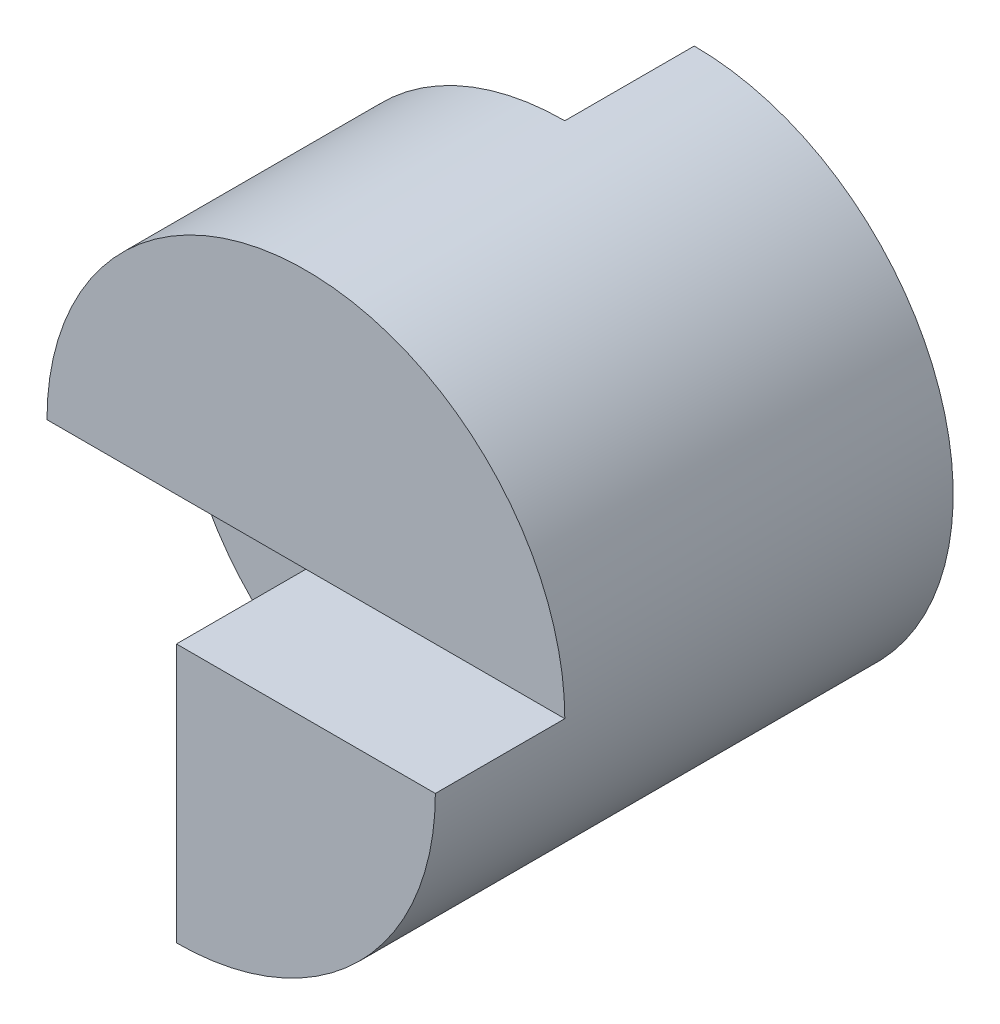
ISO-10303-21;
HEADER;
FILE_DESCRIPTION(('STEP AP214'),'2;1');
FILE_NAME('part.step','',(''),(''),'','','');
FILE_SCHEMA(('AUTOMOTIVE_DESIGN { 1 0 10303 214 1 1 1 1 }'));
ENDSEC;
DATA;
#1=APPLICATION_CONTEXT('core data for automotive mechanical design processes');
#2=APPLICATION_PROTOCOL_DEFINITION('international standard','automotive_design',2000,#1);
#3=PRODUCT_CONTEXT('',#1,'mechanical');
#4=PRODUCT('Part','Part','',(#3));
#5=PRODUCT_RELATED_PRODUCT_CATEGORY('part','',(#4));
#6=PRODUCT_DEFINITION_FORMATION('','',#4);
#7=PRODUCT_DEFINITION_CONTEXT('part definition',#1,'design');
#8=PRODUCT_DEFINITION('design','',#6,#7);
#9=PRODUCT_DEFINITION_SHAPE('','',#8);
#10=(LENGTH_UNIT() NAMED_UNIT(*) SI_UNIT(.MILLI.,.METRE.));
#11=(NAMED_UNIT(*) PLANE_ANGLE_UNIT() SI_UNIT($,.RADIAN.));
#12=(NAMED_UNIT(*) SI_UNIT($,.STERADIAN.) SOLID_ANGLE_UNIT());
#13=UNCERTAINTY_MEASURE_WITH_UNIT(LENGTH_MEASURE(1.E-05),#10,'distance_accuracy_value','');
#14=(GEOMETRIC_REPRESENTATION_CONTEXT(3) GLOBAL_UNCERTAINTY_ASSIGNED_CONTEXT((#13)) GLOBAL_UNIT_ASSIGNED_CONTEXT((#10,
#11,#12)) REPRESENTATION_CONTEXT('',''));
#15=CARTESIAN_POINT('',(0.,0.,0.));
#16=DIRECTION('',(0.,0.,1.));
#17=DIRECTION('',(1.,0.,0.));
#18=AXIS2_PLACEMENT_3D('',#15,#16,#17);
#19=CARTESIAN_POINT('',(0.,0.,40.));
#20=DIRECTION('',(0.,0.,-1.));
#21=DIRECTION('',(-1.,0.,0.));
#22=AXIS2_PLACEMENT_3D('',#19,#20,#21);
#23=CYLINDRICAL_SURFACE('',#22,20.);
#24=CARTESIAN_POINT('',(0.,0.,40.));
#25=DIRECTION('',(0.,0.,1.));
#26=DIRECTION('',(1.,0.,0.));
#27=AXIS2_PLACEMENT_3D('',#24,#25,#26);
#28=CIRCLE('',#27,20.);
#29=CARTESIAN_POINT('',(0.,-20.,40.));
#30=VERTEX_POINT('',#29);
#31=CARTESIAN_POINT('',(20.,0.,40.));
#32=VERTEX_POINT('',#31);
#33=EDGE_CURVE('E130',#30,#32,#28,.T.);
#34=ORIENTED_EDGE('',*,*,#33,.F.);
#35=DIRECTION('',(0.,0.,1.));
#36=VECTOR('',#35,1.);
#37=CARTESIAN_POINT('',(0.,-20.,20.));
#38=LINE('',#37,#36);
#39=CARTESIAN_POINT('',(0.,-20.,20.));
#40=VERTEX_POINT('',#39);
#41=EDGE_CURVE('E112',#40,#30,#38,.T.);
#42=ORIENTED_EDGE('',*,*,#41,.F.);
#43=CARTESIAN_POINT('',(0.,0.,20.));
#44=DIRECTION('',(0.,0.,1.));
#45=DIRECTION('',(-1.,0.,0.));
#46=AXIS2_PLACEMENT_3D('',#43,#44,#45);
#47=CIRCLE('',#46,20.);
#48=CARTESIAN_POINT('',(-20.,0.,20.));
#49=VERTEX_POINT('',#48);
#50=EDGE_CURVE('E108',#49,#40,#47,.T.);
#51=ORIENTED_EDGE('',*,*,#50,.F.);
#52=DIRECTION('',(0.,0.,1.));
#53=VECTOR('',#52,1.);
#54=CARTESIAN_POINT('',(-20.,0.,20.));
#55=LINE('',#54,#53);
#56=CARTESIAN_POINT('',(-20.,0.,30.));
#57=VERTEX_POINT('',#56);
#58=EDGE_CURVE('E114',#49,#57,#55,.T.);
#59=ORIENTED_EDGE('',*,*,#58,.T.);
#60=CARTESIAN_POINT('',(0.,0.,30.));
#61=DIRECTION('',(0.,0.,1.));
#62=DIRECTION('',(1.,0.,0.));
#63=AXIS2_PLACEMENT_3D('',#60,#61,#62);
#64=CIRCLE('',#63,20.);
#65=CARTESIAN_POINT('',(20.,0.,30.));
#66=VERTEX_POINT('',#65);
#67=EDGE_CURVE('E132',#66,#57,#64,.T.);
#68=ORIENTED_EDGE('',*,*,#67,.F.);
#69=DIRECTION('',(0.,0.,1.));
#70=VECTOR('',#69,1.);
#71=CARTESIAN_POINT('',(20.,0.,30.));
#72=LINE('',#71,#70);
#73=EDGE_CURVE('E95',#66,#32,#72,.T.);
#74=ORIENTED_EDGE('',*,*,#73,.T.);
#75=EDGE_LOOP('',(#34,#42,#51,#59,#68,#74));
#76=FACE_BOUND('',#75,.T.);
#77=CARTESIAN_POINT('',(0.,0.,10.));
#78=DIRECTION('',(0.,0.,-1.));
#79=DIRECTION('',(-1.,0.,0.));
#80=AXIS2_PLACEMENT_3D('',#77,#78,#79);
#81=CIRCLE('',#80,20.);
#82=CARTESIAN_POINT('',(0.,-20.,10.));
#83=VERTEX_POINT('',#82);
#84=CARTESIAN_POINT('',(0.,20.,10.));
#85=VERTEX_POINT('',#84);
#86=EDGE_CURVE('E40',#83,#85,#81,.T.);
#87=ORIENTED_EDGE('',*,*,#86,.F.);
#88=DIRECTION('',(0.,0.,-1.));
#89=VECTOR('',#88,1.);
#90=CARTESIAN_POINT('',(0.,-20.,0.));
#91=LINE('',#90,#89);
#92=CARTESIAN_POINT('',(0.,-20.,0.));
#93=VERTEX_POINT('',#92);
#94=EDGE_CURVE('E87',#83,#93,#91,.T.);
#95=ORIENTED_EDGE('',*,*,#94,.T.);
#96=CARTESIAN_POINT('',(0.,0.,0.));
#97=DIRECTION('',(0.,0.,1.));
#98=DIRECTION('',(1.,0.,0.));
#99=AXIS2_PLACEMENT_3D('',#96,#97,#98);
#100=CIRCLE('',#99,20.);
#101=CARTESIAN_POINT('',(0.,20.,0.));
#102=VERTEX_POINT('',#101);
#103=EDGE_CURVE('E129',#93,#102,#100,.T.);
#104=ORIENTED_EDGE('',*,*,#103,.T.);
#105=DIRECTION('',(0.,0.,-1.));
#106=VECTOR('',#105,1.);
#107=CARTESIAN_POINT('',(0.,20.,40.));
#108=LINE('',#107,#106);
#109=EDGE_CURVE('E90',#85,#102,#108,.T.);
#110=ORIENTED_EDGE('',*,*,#109,.F.);
#111=EDGE_LOOP('',(#87,#95,#104,#110));
#112=FACE_BOUND('',#111,.T.);
#113=ADVANCED_FACE('F33',(#76,#112),#23,.T.);
#114=CARTESIAN_POINT('',(0.,0.,0.));
#115=DIRECTION('',(0.,0.,1.));
#116=DIRECTION('',(1.,0.,0.));
#117=AXIS2_PLACEMENT_3D('',#114,#115,#116);
#118=PLANE('',#117);
#119=ORIENTED_EDGE('',*,*,#103,.F.);
#120=DIRECTION('',(0.,-1.,0.));
#121=VECTOR('',#120,1.);
#122=CARTESIAN_POINT('',(0.,0.,0.));
#123=LINE('',#122,#121);
#124=EDGE_CURVE('E91',#102,#93,#123,.T.);
#125=ORIENTED_EDGE('',*,*,#124,.F.);
#126=EDGE_LOOP('',(#119,#125));
#127=FACE_BOUND('',#126,.T.);
#128=ADVANCED_FACE('F157',(#127),#118,.F.);
#129=CARTESIAN_POINT('',(0.,0.,40.));
#130=DIRECTION('',(0.,0.,1.));
#131=DIRECTION('',(1.,0.,0.));
#132=AXIS2_PLACEMENT_3D('',#129,#130,#131);
#133=PLANE('',#132);
#134=DIRECTION('',(0.,1.,0.));
#135=VECTOR('',#134,1.);
#136=CARTESIAN_POINT('',(0.,0.,40.));
#137=LINE('',#136,#135);
#138=CARTESIAN_POINT('',(0.,0.,40.));
#139=VERTEX_POINT('',#138);
#140=EDGE_CURVE('E47',#30,#139,#137,.T.);
#141=ORIENTED_EDGE('',*,*,#140,.F.);
#142=ORIENTED_EDGE('',*,*,#33,.T.);
#143=DIRECTION('',(1.,0.,0.));
#144=VECTOR('',#143,1.);
#145=CARTESIAN_POINT('',(-20.,0.,40.));
#146=LINE('',#145,#144);
#147=EDGE_CURVE('E122',#139,#32,#146,.T.);
#148=ORIENTED_EDGE('',*,*,#147,.F.);
#149=EDGE_LOOP('',(#141,#142,#148));
#150=FACE_BOUND('',#149,.T.);
#151=ADVANCED_FACE('F155',(#150),#133,.T.);
#152=CARTESIAN_POINT('',(-20.,40.,30.));
#153=DIRECTION('',(0.,0.,1.));
#154=DIRECTION('',(1.,0.,0.));
#155=AXIS2_PLACEMENT_3D('',#152,#153,#154);
#156=PLANE('',#155);
#157=ORIENTED_EDGE('',*,*,#67,.T.);
#158=DIRECTION('',(-1.,0.,0.));
#159=VECTOR('',#158,1.);
#160=CARTESIAN_POINT('',(-20.,0.,30.));
#161=LINE('',#160,#159);
#162=CARTESIAN_POINT('',(0.,0.,30.));
#163=VERTEX_POINT('',#162);
#164=EDGE_CURVE('E125',#163,#57,#161,.T.);
#165=ORIENTED_EDGE('',*,*,#164,.F.);
#166=EDGE_CURVE('E126',#66,#163,#161,.T.);
#167=ORIENTED_EDGE('',*,*,#166,.F.);
#168=EDGE_LOOP('',(#157,#165,#167));
#169=FACE_BOUND('',#168,.T.);
#170=ADVANCED_FACE('F139',(#169),#156,.T.);
#171=CARTESIAN_POINT('',(0.,0.,0.));
#172=DIRECTION('',(0.,-1.,0.));
#173=DIRECTION('',(0.,0.,-1.));
#174=AXIS2_PLACEMENT_3D('',#171,#172,#173);
#175=PLANE('',#174);
#176=ORIENTED_EDGE('',*,*,#166,.T.);
#177=DIRECTION('',(0.,0.,1.));
#178=VECTOR('',#177,1.);
#179=CARTESIAN_POINT('',(0.,0.,0.));
#180=LINE('',#179,#178);
#181=EDGE_CURVE('E11',#163,#139,#180,.T.);
#182=ORIENTED_EDGE('',*,*,#181,.T.);
#183=ORIENTED_EDGE('',*,*,#147,.T.);
#184=ORIENTED_EDGE('',*,*,#73,.F.);
#185=EDGE_LOOP('',(#176,#182,#183,#184));
#186=FACE_BOUND('',#185,.T.);
#187=ADVANCED_FACE('F153',(#186),#175,.F.);
#188=CARTESIAN_POINT('',(-20.,40.,10.));
#189=DIRECTION('',(0.,0.,-1.));
#190=DIRECTION('',(-1.,0.,0.));
#191=AXIS2_PLACEMENT_3D('',#188,#189,#190);
#192=PLANE('',#191);
#193=ORIENTED_EDGE('',*,*,#86,.T.);
#194=DIRECTION('',(0.,-1.,0.));
#195=VECTOR('',#194,1.);
#196=CARTESIAN_POINT('',(0.,40.,10.));
#197=LINE('',#196,#195);
#198=EDGE_CURVE('E92',#85,#83,#197,.T.);
#199=ORIENTED_EDGE('',*,*,#198,.T.);
#200=EDGE_LOOP('',(#193,#199));
#201=FACE_BOUND('',#200,.T.);
#202=ADVANCED_FACE('F93',(#201),#192,.T.);
#203=CARTESIAN_POINT('',(0.,40.,0.));
#204=DIRECTION('',(-1.,0.,0.));
#205=DIRECTION('',(0.,0.,1.));
#206=AXIS2_PLACEMENT_3D('',#203,#204,#205);
#207=PLANE('',#206);
#208=ORIENTED_EDGE('',*,*,#109,.T.);
#209=ORIENTED_EDGE('',*,*,#124,.T.);
#210=ORIENTED_EDGE('',*,*,#94,.F.);
#211=ORIENTED_EDGE('',*,*,#198,.F.);
#212=EDGE_LOOP('',(#208,#209,#210,#211));
#213=FACE_BOUND('',#212,.T.);
#214=ADVANCED_FACE('F97',(#213),#207,.T.);
#215=CARTESIAN_POINT('',(0.,0.,20.));
#216=DIRECTION('',(1.,0.,0.));
#217=DIRECTION('',(0.,1.,0.));
#218=AXIS2_PLACEMENT_3D('',#215,#216,#217);
#219=PLANE('',#218);
#220=ORIENTED_EDGE('',*,*,#140,.T.);
#221=ORIENTED_EDGE('',*,*,#181,.F.);
#222=DIRECTION('',(0.,0.,1.));
#223=VECTOR('',#222,1.);
#224=CARTESIAN_POINT('',(0.,0.,20.));
#225=LINE('',#224,#223);
#226=CARTESIAN_POINT('',(0.,0.,20.));
#227=VERTEX_POINT('',#226);
#228=EDGE_CURVE('E110',#227,#163,#225,.T.);
#229=ORIENTED_EDGE('',*,*,#228,.F.);
#230=DIRECTION('',(0.,1.,0.));
#231=VECTOR('',#230,1.);
#232=CARTESIAN_POINT('',(0.,0.,20.));
#233=LINE('',#232,#231);
#234=EDGE_CURVE('E100',#40,#227,#233,.T.);
#235=ORIENTED_EDGE('',*,*,#234,.F.);
#236=ORIENTED_EDGE('',*,*,#41,.T.);
#237=EDGE_LOOP('',(#220,#221,#229,#235,#236));
#238=FACE_BOUND('',#237,.T.);
#239=ADVANCED_FACE('F150',(#238),#219,.F.);
#240=CARTESIAN_POINT('',(-20.,0.,20.));
#241=DIRECTION('',(0.,1.,0.));
#242=DIRECTION('',(-1.,0.,0.));
#243=AXIS2_PLACEMENT_3D('',#240,#241,#242);
#244=PLANE('',#243);
#245=ORIENTED_EDGE('',*,*,#164,.T.);
#246=ORIENTED_EDGE('',*,*,#58,.F.);
#247=DIRECTION('',(-1.,0.,0.));
#248=VECTOR('',#247,1.);
#249=CARTESIAN_POINT('',(-20.,0.,20.));
#250=LINE('',#249,#248);
#251=EDGE_CURVE('E105',#227,#49,#250,.T.);
#252=ORIENTED_EDGE('',*,*,#251,.F.);
#253=ORIENTED_EDGE('',*,*,#228,.T.);
#254=EDGE_LOOP('',(#245,#246,#252,#253));
#255=FACE_BOUND('',#254,.T.);
#256=ADVANCED_FACE('F147',(#255),#244,.F.);
#257=CARTESIAN_POINT('',(0.,0.,20.));
#258=DIRECTION('',(0.,0.,-1.));
#259=DIRECTION('',(-1.,0.,0.));
#260=AXIS2_PLACEMENT_3D('',#257,#258,#259);
#261=PLANE('',#260);
#262=ORIENTED_EDGE('',*,*,#234,.T.);
#263=ORIENTED_EDGE('',*,*,#251,.T.);
#264=ORIENTED_EDGE('',*,*,#50,.T.);
#265=EDGE_LOOP('',(#262,#263,#264));
#266=FACE_BOUND('',#265,.T.);
#267=ADVANCED_FACE('F149',(#266),#261,.F.);
#268=CLOSED_SHELL('',(#113,#128,#151,#170,#187,#202,#214,#239,#256,#267));
#269=MANIFOLD_SOLID_BREP('B2',#268);
#270=ADVANCED_BREP_SHAPE_REPRESENTATION('',(#18,#269),#14);
#271=SHAPE_DEFINITION_REPRESENTATION(#9,#270);
ENDSEC;
END-ISO-10303-21;
